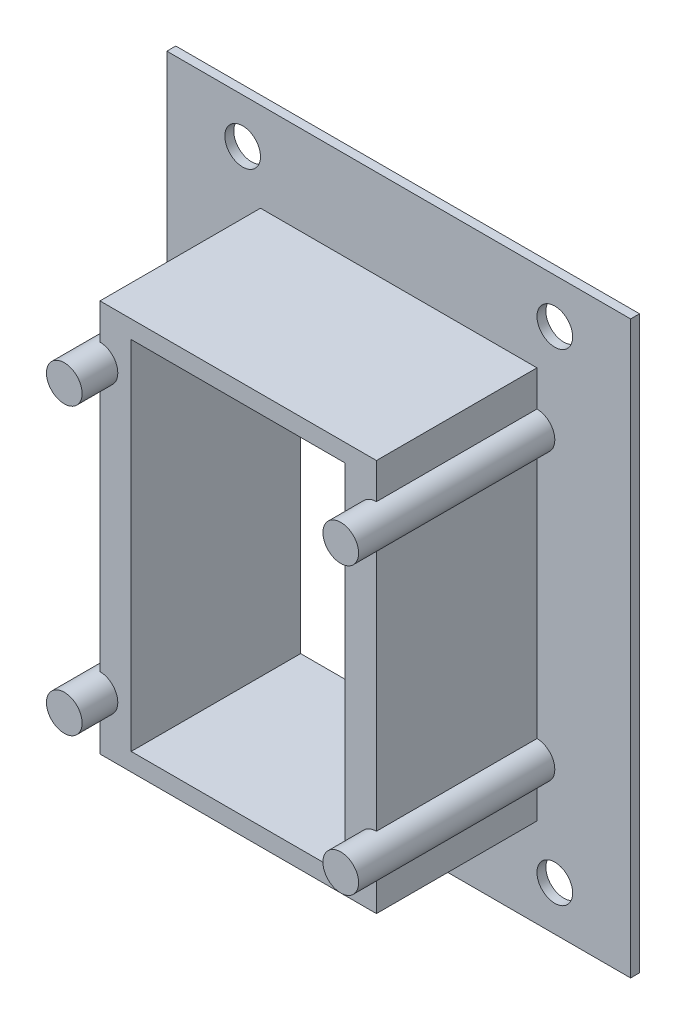
ISO-10303-21;
HEADER;
FILE_DESCRIPTION(('STEP AP214'),'2;1');
FILE_NAME('part.step','',(''),(''),'','','');
FILE_SCHEMA(('AUTOMOTIVE_DESIGN { 1 0 10303 214 1 1 1 1 }'));
ENDSEC;
DATA;
#1=APPLICATION_CONTEXT('core data for automotive mechanical design processes');
#2=APPLICATION_PROTOCOL_DEFINITION('international standard','automotive_design',2000,#1);
#3=PRODUCT_CONTEXT('',#1,'mechanical');
#4=PRODUCT('Part','Part','',(#3));
#5=PRODUCT_RELATED_PRODUCT_CATEGORY('part','',(#4));
#6=PRODUCT_DEFINITION_FORMATION('','',#4);
#7=PRODUCT_DEFINITION_CONTEXT('part definition',#1,'design');
#8=PRODUCT_DEFINITION('design','',#6,#7);
#9=PRODUCT_DEFINITION_SHAPE('','',#8);
#10=(LENGTH_UNIT() NAMED_UNIT(*) SI_UNIT(.MILLI.,.METRE.));
#11=(NAMED_UNIT(*) PLANE_ANGLE_UNIT() SI_UNIT($,.RADIAN.));
#12=(NAMED_UNIT(*) SI_UNIT($,.STERADIAN.) SOLID_ANGLE_UNIT());
#13=UNCERTAINTY_MEASURE_WITH_UNIT(LENGTH_MEASURE(1.E-05),#10,'distance_accuracy_value','');
#14=(GEOMETRIC_REPRESENTATION_CONTEXT(3) GLOBAL_UNCERTAINTY_ASSIGNED_CONTEXT((#13)) GLOBAL_UNIT_ASSIGNED_CONTEXT((#10,
#11,#12)) REPRESENTATION_CONTEXT('',''));
#15=CARTESIAN_POINT('',(0.,0.,0.));
#16=DIRECTION('',(0.,0.,1.));
#17=DIRECTION('',(1.,0.,0.));
#18=AXIS2_PLACEMENT_3D('',#15,#16,#17);
#19=CARTESIAN_POINT('',(24.60625,-34.925,30.1625));
#20=DIRECTION('',(-1.,0.,0.));
#21=DIRECTION('',(0.,0.,1.));
#22=AXIS2_PLACEMENT_3D('',#19,#20,#21);
#23=PLANE('',#22);
#24=DIRECTION('',(0.,0.,-1.));
#25=VECTOR('',#24,1.);
#26=CARTESIAN_POINT('',(24.60625,-22.225,36.5125));
#27=LINE('',#26,#25);
#28=CARTESIAN_POINT('',(24.60625,-22.225,1.5875));
#29=VERTEX_POINT('',#28);
#30=CARTESIAN_POINT('',(24.60625,-22.225,30.1625));
#31=VERTEX_POINT('',#30);
#32=EDGE_CURVE('E268',#29,#31,#27,.F.);
#33=ORIENTED_EDGE('',*,*,#32,.F.);
#34=DIRECTION('',(0.,1.,0.));
#35=VECTOR('',#34,1.);
#36=CARTESIAN_POINT('',(24.60625,-34.925,1.5875));
#37=LINE('',#36,#35);
#38=CARTESIAN_POINT('',(24.60625,22.225,1.5875));
#39=VERTEX_POINT('',#38);
#40=EDGE_CURVE('E343',#29,#39,#37,.T.);
#41=ORIENTED_EDGE('',*,*,#40,.T.);
#42=DIRECTION('',(0.,0.,-1.));
#43=VECTOR('',#42,1.);
#44=CARTESIAN_POINT('',(24.60625,22.225,36.5125));
#45=LINE('',#44,#43);
#46=CARTESIAN_POINT('',(24.60625,22.225,30.1625));
#47=VERTEX_POINT('',#46);
#48=EDGE_CURVE('E293',#47,#39,#45,.T.);
#49=ORIENTED_EDGE('',*,*,#48,.F.);
#50=DIRECTION('',(0.,1.,0.));
#51=VECTOR('',#50,1.);
#52=CARTESIAN_POINT('',(24.60625,-34.925,30.1625));
#53=LINE('',#52,#51);
#54=EDGE_CURVE('E325',#31,#47,#53,.T.);
#55=ORIENTED_EDGE('',*,*,#54,.F.);
#56=EDGE_LOOP('',(#33,#41,#49,#55));
#57=FACE_BOUND('',#56,.T.);
#58=ADVANCED_FACE('F38',(#57),#23,.F.);
#59=DIRECTION('',(0.,0.,-1.));
#60=VECTOR('',#59,1.);
#61=CARTESIAN_POINT('',(24.60625,-28.575,36.5125));
#62=LINE('',#61,#60);
#63=CARTESIAN_POINT('',(24.60625,-28.575,30.1625));
#64=VERTEX_POINT('',#63);
#65=CARTESIAN_POINT('',(24.60625,-28.575,1.5875));
#66=VERTEX_POINT('',#65);
#67=EDGE_CURVE('E261',#64,#66,#62,.T.);
#68=ORIENTED_EDGE('',*,*,#67,.F.);
#69=CARTESIAN_POINT('',(24.60625,-34.925,30.1625));
#70=VERTEX_POINT('',#69);
#71=EDGE_CURVE('E321',#70,#64,#53,.T.);
#72=ORIENTED_EDGE('',*,*,#71,.F.);
#73=DIRECTION('',(0.,0.,-1.));
#74=VECTOR('',#73,1.);
#75=CARTESIAN_POINT('',(24.60625,-34.925,30.1625));
#76=LINE('',#75,#74);
#77=CARTESIAN_POINT('',(24.60625,-34.925,1.5875));
#78=VERTEX_POINT('',#77);
#79=EDGE_CURVE('E337',#70,#78,#76,.T.);
#80=ORIENTED_EDGE('',*,*,#79,.T.);
#81=EDGE_CURVE('E338',#78,#66,#37,.T.);
#82=ORIENTED_EDGE('',*,*,#81,.T.);
#83=EDGE_LOOP('',(#68,#72,#80,#82));
#84=FACE_BOUND('',#83,.T.);
#85=ADVANCED_FACE('F470',(#84),#23,.F.);
#86=CARTESIAN_POINT('',(-24.60625,-34.925,30.1625));
#87=DIRECTION('',(1.,0.,0.));
#88=DIRECTION('',(0.,0.,-1.));
#89=AXIS2_PLACEMENT_3D('',#86,#87,#88);
#90=PLANE('',#89);
#91=DIRECTION('',(0.,0.,-1.));
#92=VECTOR('',#91,1.);
#93=CARTESIAN_POINT('',(-24.60625,-28.575,36.5125));
#94=LINE('',#93,#92);
#95=CARTESIAN_POINT('',(-24.60625,-28.575,1.5875));
#96=VERTEX_POINT('',#95);
#97=CARTESIAN_POINT('',(-24.60625,-28.575,30.1625));
#98=VERTEX_POINT('',#97);
#99=EDGE_CURVE('E284',#96,#98,#94,.F.);
#100=ORIENTED_EDGE('',*,*,#99,.F.);
#101=DIRECTION('',(0.,-1.,0.));
#102=VECTOR('',#101,1.);
#103=CARTESIAN_POINT('',(-24.60625,-34.925,1.5875));
#104=LINE('',#103,#102);
#105=CARTESIAN_POINT('',(-24.60625,-34.925,1.5875));
#106=VERTEX_POINT('',#105);
#107=EDGE_CURVE('E347',#96,#106,#104,.T.);
#108=ORIENTED_EDGE('',*,*,#107,.T.);
#109=DIRECTION('',(0.,0.,-1.));
#110=VECTOR('',#109,1.);
#111=CARTESIAN_POINT('',(-24.60625,-34.925,30.1625));
#112=LINE('',#111,#110);
#113=CARTESIAN_POINT('',(-24.60625,-34.925,30.1625));
#114=VERTEX_POINT('',#113);
#115=EDGE_CURVE('E360',#114,#106,#112,.T.);
#116=ORIENTED_EDGE('',*,*,#115,.F.);
#117=DIRECTION('',(0.,-1.,0.));
#118=VECTOR('',#117,1.);
#119=CARTESIAN_POINT('',(-24.60625,-34.925,30.1625));
#120=LINE('',#119,#118);
#121=EDGE_CURVE('E329',#98,#114,#120,.T.);
#122=ORIENTED_EDGE('',*,*,#121,.F.);
#123=EDGE_LOOP('',(#100,#108,#116,#122));
#124=FACE_BOUND('',#123,.T.);
#125=ADVANCED_FACE('F432',(#124),#90,.F.);
#126=DIRECTION('',(0.,0.,-1.));
#127=VECTOR('',#126,1.);
#128=CARTESIAN_POINT('',(-24.60625,-22.225,36.5125));
#129=LINE('',#128,#127);
#130=CARTESIAN_POINT('',(-24.60625,-22.225,30.1625));
#131=VERTEX_POINT('',#130);
#132=CARTESIAN_POINT('',(-24.60625,-22.225,1.5875));
#133=VERTEX_POINT('',#132);
#134=EDGE_CURVE('E277',#131,#133,#129,.T.);
#135=ORIENTED_EDGE('',*,*,#134,.F.);
#136=CARTESIAN_POINT('',(-24.60625,22.225,30.1625));
#137=VERTEX_POINT('',#136);
#138=EDGE_CURVE('E334',#137,#131,#120,.T.);
#139=ORIENTED_EDGE('',*,*,#138,.F.);
#140=DIRECTION('',(0.,0.,-1.));
#141=VECTOR('',#140,1.);
#142=CARTESIAN_POINT('',(-24.60625,22.225,36.5125));
#143=LINE('',#142,#141);
#144=CARTESIAN_POINT('',(-24.60625,22.225,1.5875));
#145=VERTEX_POINT('',#144);
#146=EDGE_CURVE('E316',#145,#137,#143,.F.);
#147=ORIENTED_EDGE('',*,*,#146,.F.);
#148=EDGE_CURVE('E353',#145,#133,#104,.T.);
#149=ORIENTED_EDGE('',*,*,#148,.T.);
#150=EDGE_LOOP('',(#135,#139,#147,#149));
#151=FACE_BOUND('',#150,.T.);
#152=ADVANCED_FACE('F485',(#151),#90,.F.);
#153=DIRECTION('',(0.,0.,-1.));
#154=VECTOR('',#153,1.);
#155=CARTESIAN_POINT('',(24.60625,28.575,36.5125));
#156=LINE('',#155,#154);
#157=CARTESIAN_POINT('',(24.60625,28.575,1.5875));
#158=VERTEX_POINT('',#157);
#159=CARTESIAN_POINT('',(24.60625,28.575,30.1625));
#160=VERTEX_POINT('',#159);
#161=EDGE_CURVE('E300',#158,#160,#156,.F.);
#162=ORIENTED_EDGE('',*,*,#161,.F.);
#163=CARTESIAN_POINT('',(24.60625,34.925,1.5875));
#164=VERTEX_POINT('',#163);
#165=EDGE_CURVE('E320',#158,#164,#37,.T.);
#166=ORIENTED_EDGE('',*,*,#165,.T.);
#167=DIRECTION('',(0.,0.,-1.));
#168=VECTOR('',#167,1.);
#169=CARTESIAN_POINT('',(24.60625,34.925,30.1625));
#170=LINE('',#169,#168);
#171=CARTESIAN_POINT('',(24.60625,34.925,30.1625));
#172=VERTEX_POINT('',#171);
#173=EDGE_CURVE('E368',#172,#164,#170,.T.);
#174=ORIENTED_EDGE('',*,*,#173,.F.);
#175=EDGE_CURVE('E326',#160,#172,#53,.T.);
#176=ORIENTED_EDGE('',*,*,#175,.F.);
#177=EDGE_LOOP('',(#162,#166,#174,#176));
#178=FACE_BOUND('',#177,.T.);
#179=ADVANCED_FACE('F448',(#178),#23,.F.);
#180=DIRECTION('',(0.,0.,-1.));
#181=VECTOR('',#180,1.);
#182=CARTESIAN_POINT('',(-24.60625,28.575,36.5125));
#183=LINE('',#182,#181);
#184=CARTESIAN_POINT('',(-24.60625,28.575,30.1625));
#185=VERTEX_POINT('',#184);
#186=CARTESIAN_POINT('',(-24.60625,28.575,1.5875));
#187=VERTEX_POINT('',#186);
#188=EDGE_CURVE('E309',#185,#187,#183,.T.);
#189=ORIENTED_EDGE('',*,*,#188,.F.);
#190=CARTESIAN_POINT('',(-24.60625,34.925,30.1625));
#191=VERTEX_POINT('',#190);
#192=EDGE_CURVE('E330',#191,#185,#120,.T.);
#193=ORIENTED_EDGE('',*,*,#192,.F.);
#194=DIRECTION('',(0.,0.,-1.));
#195=VECTOR('',#194,1.);
#196=CARTESIAN_POINT('',(-24.60625,34.925,30.1625));
#197=LINE('',#196,#195);
#198=CARTESIAN_POINT('',(-24.60625,34.925,1.5875));
#199=VERTEX_POINT('',#198);
#200=EDGE_CURVE('E364',#191,#199,#197,.T.);
#201=ORIENTED_EDGE('',*,*,#200,.T.);
#202=EDGE_CURVE('E348',#199,#187,#104,.T.);
#203=ORIENTED_EDGE('',*,*,#202,.T.);
#204=EDGE_LOOP('',(#189,#193,#201,#203));
#205=FACE_BOUND('',#204,.T.);
#206=ADVANCED_FACE('F484',(#205),#90,.F.);
#207=CARTESIAN_POINT('',(0.,0.,1.5875));
#208=DIRECTION('',(0.,0.,-1.));
#209=DIRECTION('',(-1.,0.,0.));
#210=AXIS2_PLACEMENT_3D('',#207,#208,#209);
#211=PLANE('',#210);
#212=CARTESIAN_POINT('',(-27.78125,42.8625,1.5875));
#213=DIRECTION('',(0.,0.,1.));
#214=DIRECTION('',(1.,0.,0.));
#215=AXIS2_PLACEMENT_3D('',#212,#213,#214);
#216=CIRCLE('',#215,3.175);
#217=CARTESIAN_POINT('',(-24.60625,42.8625,1.5875));
#218=VERTEX_POINT('',#217);
#219=EDGE_CURVE('E219',#218,#218,#216,.T.);
#220=ORIENTED_EDGE('',*,*,#219,.F.);
#221=EDGE_LOOP('',(#220));
#222=FACE_BOUND('',#221,.T.);
#223=CARTESIAN_POINT('',(27.78125,42.8625,1.5875));
#224=DIRECTION('',(0.,0.,1.));
#225=DIRECTION('',(1.,0.,0.));
#226=AXIS2_PLACEMENT_3D('',#223,#224,#225);
#227=CIRCLE('',#226,3.175);
#228=CARTESIAN_POINT('',(30.95625,42.8625,1.5875));
#229=VERTEX_POINT('',#228);
#230=EDGE_CURVE('E232',#229,#229,#227,.T.);
#231=ORIENTED_EDGE('',*,*,#230,.F.);
#232=EDGE_LOOP('',(#231));
#233=FACE_BOUND('',#232,.T.);
#234=CARTESIAN_POINT('',(-27.78125,-42.8625,1.5875));
#235=DIRECTION('',(0.,0.,1.));
#236=DIRECTION('',(1.,0.,0.));
#237=AXIS2_PLACEMENT_3D('',#234,#235,#236);
#238=CIRCLE('',#237,3.175);
#239=CARTESIAN_POINT('',(-24.60625,-42.8625,1.5875));
#240=VERTEX_POINT('',#239);
#241=EDGE_CURVE('E240',#240,#240,#238,.T.);
#242=ORIENTED_EDGE('',*,*,#241,.F.);
#243=EDGE_LOOP('',(#242));
#244=FACE_BOUND('',#243,.T.);
#245=CARTESIAN_POINT('',(27.78125,-42.8625,1.5875));
#246=DIRECTION('',(0.,0.,1.));
#247=DIRECTION('',(1.,0.,0.));
#248=AXIS2_PLACEMENT_3D('',#245,#246,#247);
#249=CIRCLE('',#248,3.175);
#250=CARTESIAN_POINT('',(30.95625,-42.8625,1.5875));
#251=VERTEX_POINT('',#250);
#252=EDGE_CURVE('E248',#251,#251,#249,.T.);
#253=ORIENTED_EDGE('',*,*,#252,.F.);
#254=EDGE_LOOP('',(#253));
#255=FACE_BOUND('',#254,.T.);
#256=CARTESIAN_POINT('',(24.60625,-25.4,1.5875));
#257=DIRECTION('',(0.,0.,1.));
#258=DIRECTION('',(1.,0.,0.));
#259=AXIS2_PLACEMENT_3D('',#256,#257,#258);
#260=CIRCLE('',#259,3.175);
#261=EDGE_CURVE('E256',#66,#29,#260,.T.);
#262=ORIENTED_EDGE('',*,*,#261,.F.);
#263=ORIENTED_EDGE('',*,*,#81,.F.);
#264=DIRECTION('',(1.,0.,0.));
#265=VECTOR('',#264,1.);
#266=CARTESIAN_POINT('',(-24.60625,-34.925,1.5875));
#267=LINE('',#266,#265);
#268=EDGE_CURVE('E352',#106,#78,#267,.T.);
#269=ORIENTED_EDGE('',*,*,#268,.F.);
#270=ORIENTED_EDGE('',*,*,#107,.F.);
#271=CARTESIAN_POINT('',(-24.60625,-25.4,1.5875));
#272=DIRECTION('',(0.,0.,1.));
#273=DIRECTION('',(1.,0.,0.));
#274=AXIS2_PLACEMENT_3D('',#271,#272,#273);
#275=CIRCLE('',#274,3.175);
#276=EDGE_CURVE('E272',#133,#96,#275,.T.);
#277=ORIENTED_EDGE('',*,*,#276,.F.);
#278=ORIENTED_EDGE('',*,*,#148,.F.);
#279=CARTESIAN_POINT('',(-24.60625,25.4,1.5875));
#280=DIRECTION('',(0.,0.,1.));
#281=DIRECTION('',(1.,0.,0.));
#282=AXIS2_PLACEMENT_3D('',#279,#280,#281);
#283=CIRCLE('',#282,3.175);
#284=EDGE_CURVE('E304',#187,#145,#283,.T.);
#285=ORIENTED_EDGE('',*,*,#284,.F.);
#286=ORIENTED_EDGE('',*,*,#202,.F.);
#287=DIRECTION('',(-1.,0.,0.));
#288=VECTOR('',#287,1.);
#289=CARTESIAN_POINT('',(-24.60625,34.925,1.5875));
#290=LINE('',#289,#288);
#291=EDGE_CURVE('E342',#164,#199,#290,.T.);
#292=ORIENTED_EDGE('',*,*,#291,.F.);
#293=ORIENTED_EDGE('',*,*,#165,.F.);
#294=CARTESIAN_POINT('',(24.60625,25.4,1.5875));
#295=DIRECTION('',(0.,0.,1.));
#296=DIRECTION('',(1.,0.,0.));
#297=AXIS2_PLACEMENT_3D('',#294,#295,#296);
#298=CIRCLE('',#297,3.175);
#299=EDGE_CURVE('E288',#39,#158,#298,.T.);
#300=ORIENTED_EDGE('',*,*,#299,.F.);
#301=ORIENTED_EDGE('',*,*,#40,.F.);
#302=EDGE_LOOP('',(#262,#263,#269,#270,#277,#278,#285,#286,#292,#293,#300,#301));
#303=FACE_BOUND('',#302,.T.);
#304=DIRECTION('',(0.,1.,0.));
#305=VECTOR('',#304,1.);
#306=CARTESIAN_POINT('',(41.275,-50.8,1.5875));
#307=LINE('',#306,#305);
#308=CARTESIAN_POINT('',(41.275,-50.8,1.5875));
#309=VERTEX_POINT('',#308);
#310=CARTESIAN_POINT('',(41.275,50.8,1.5875));
#311=VERTEX_POINT('',#310);
#312=EDGE_CURVE('E373',#309,#311,#307,.T.);
#313=ORIENTED_EDGE('',*,*,#312,.T.);
#314=DIRECTION('',(-1.,0.,0.));
#315=VECTOR('',#314,1.);
#316=CARTESIAN_POINT('',(-41.275,50.8,1.5875));
#317=LINE('',#316,#315);
#318=CARTESIAN_POINT('',(-41.275,50.8,1.5875));
#319=VERTEX_POINT('',#318);
#320=EDGE_CURVE('E377',#311,#319,#317,.T.);
#321=ORIENTED_EDGE('',*,*,#320,.T.);
#322=DIRECTION('',(0.,-1.,0.));
#323=VECTOR('',#322,1.);
#324=CARTESIAN_POINT('',(-41.275,-50.8,1.5875));
#325=LINE('',#324,#323);
#326=CARTESIAN_POINT('',(-41.275,-50.8,1.5875));
#327=VERTEX_POINT('',#326);
#328=EDGE_CURVE('E381',#319,#327,#325,.T.);
#329=ORIENTED_EDGE('',*,*,#328,.T.);
#330=DIRECTION('',(1.,0.,0.));
#331=VECTOR('',#330,1.);
#332=CARTESIAN_POINT('',(-41.275,-50.8,1.5875));
#333=LINE('',#332,#331);
#334=EDGE_CURVE('E384',#327,#309,#333,.T.);
#335=ORIENTED_EDGE('',*,*,#334,.T.);
#336=EDGE_LOOP('',(#313,#321,#329,#335));
#337=FACE_BOUND('',#336,.T.);
#338=ADVANCED_FACE('F452',(#222,#233,#244,#255,#303,#337),#211,.F.);
#339=CARTESIAN_POINT('',(41.275,-50.8,1.5875));
#340=DIRECTION('',(-1.,0.,0.));
#341=DIRECTION('',(0.,0.,1.));
#342=AXIS2_PLACEMENT_3D('',#339,#340,#341);
#343=PLANE('',#342);
#344=DIRECTION('',(0.,1.,0.));
#345=VECTOR('',#344,1.);
#346=CARTESIAN_POINT('',(41.275,-50.8,0.));
#347=LINE('',#346,#345);
#348=CARTESIAN_POINT('',(41.275,-50.8,0.));
#349=VERTEX_POINT('',#348);
#350=CARTESIAN_POINT('',(41.275,50.8,0.));
#351=VERTEX_POINT('',#350);
#352=EDGE_CURVE('E372',#349,#351,#347,.T.);
#353=ORIENTED_EDGE('',*,*,#352,.T.);
#354=DIRECTION('',(0.,0.,-1.));
#355=VECTOR('',#354,1.);
#356=CARTESIAN_POINT('',(41.275,50.8,1.5875));
#357=LINE('',#356,#355);
#358=EDGE_CURVE('E410',#311,#351,#357,.T.);
#359=ORIENTED_EDGE('',*,*,#358,.F.);
#360=ORIENTED_EDGE('',*,*,#312,.F.);
#361=DIRECTION('',(0.,0.,-1.));
#362=VECTOR('',#361,1.);
#363=CARTESIAN_POINT('',(41.275,-50.8,1.5875));
#364=LINE('',#363,#362);
#365=EDGE_CURVE('E387',#309,#349,#364,.T.);
#366=ORIENTED_EDGE('',*,*,#365,.T.);
#367=EDGE_LOOP('',(#353,#359,#360,#366));
#368=FACE_BOUND('',#367,.T.);
#369=ADVANCED_FACE('F40',(#368),#343,.F.);
#370=CARTESIAN_POINT('',(-41.275,50.8,1.5875));
#371=DIRECTION('',(0.,-1.,0.));
#372=DIRECTION('',(0.,0.,-1.));
#373=AXIS2_PLACEMENT_3D('',#370,#371,#372);
#374=PLANE('',#373);
#375=DIRECTION('',(-1.,0.,0.));
#376=VECTOR('',#375,1.);
#377=CARTESIAN_POINT('',(-41.275,50.8,0.));
#378=LINE('',#377,#376);
#379=CARTESIAN_POINT('',(-41.275,50.8,0.));
#380=VERTEX_POINT('',#379);
#381=EDGE_CURVE('E391',#351,#380,#378,.T.);
#382=ORIENTED_EDGE('',*,*,#381,.T.);
#383=DIRECTION('',(0.,0.,-1.));
#384=VECTOR('',#383,1.);
#385=CARTESIAN_POINT('',(-41.275,50.8,1.5875));
#386=LINE('',#385,#384);
#387=EDGE_CURVE('E406',#319,#380,#386,.T.);
#388=ORIENTED_EDGE('',*,*,#387,.F.);
#389=ORIENTED_EDGE('',*,*,#320,.F.);
#390=ORIENTED_EDGE('',*,*,#358,.T.);
#391=EDGE_LOOP('',(#382,#388,#389,#390));
#392=FACE_BOUND('',#391,.T.);
#393=ADVANCED_FACE('F515',(#392),#374,.F.);
#394=CARTESIAN_POINT('',(-41.275,-50.8,1.5875));
#395=DIRECTION('',(1.,0.,0.));
#396=DIRECTION('',(0.,0.,-1.));
#397=AXIS2_PLACEMENT_3D('',#394,#395,#396);
#398=PLANE('',#397);
#399=DIRECTION('',(0.,-1.,0.));
#400=VECTOR('',#399,1.);
#401=CARTESIAN_POINT('',(-41.275,-50.8,0.));
#402=LINE('',#401,#400);
#403=CARTESIAN_POINT('',(-41.275,-50.8,0.));
#404=VERTEX_POINT('',#403);
#405=EDGE_CURVE('E394',#380,#404,#402,.T.);
#406=ORIENTED_EDGE('',*,*,#405,.T.);
#407=DIRECTION('',(0.,0.,-1.));
#408=VECTOR('',#407,1.);
#409=CARTESIAN_POINT('',(-41.275,-50.8,1.5875));
#410=LINE('',#409,#408);
#411=EDGE_CURVE('E402',#327,#404,#410,.T.);
#412=ORIENTED_EDGE('',*,*,#411,.F.);
#413=ORIENTED_EDGE('',*,*,#328,.F.);
#414=ORIENTED_EDGE('',*,*,#387,.T.);
#415=EDGE_LOOP('',(#406,#412,#413,#414));
#416=FACE_BOUND('',#415,.T.);
#417=ADVANCED_FACE('F510',(#416),#398,.F.);
#418=CARTESIAN_POINT('',(-41.275,-50.8,1.5875));
#419=DIRECTION('',(0.,1.,0.));
#420=DIRECTION('',(0.,0.,1.));
#421=AXIS2_PLACEMENT_3D('',#418,#419,#420);
#422=PLANE('',#421);
#423=DIRECTION('',(1.,0.,0.));
#424=VECTOR('',#423,1.);
#425=CARTESIAN_POINT('',(-41.275,-50.8,0.));
#426=LINE('',#425,#424);
#427=EDGE_CURVE('E378',#404,#349,#426,.T.);
#428=ORIENTED_EDGE('',*,*,#427,.T.);
#429=ORIENTED_EDGE('',*,*,#365,.F.);
#430=ORIENTED_EDGE('',*,*,#334,.F.);
#431=ORIENTED_EDGE('',*,*,#411,.T.);
#432=EDGE_LOOP('',(#428,#429,#430,#431));
#433=FACE_BOUND('',#432,.T.);
#434=ADVANCED_FACE('F504',(#433),#422,.F.);
#435=CARTESIAN_POINT('',(0.,0.,0.));
#436=DIRECTION('',(0.,0.,-1.));
#437=DIRECTION('',(-1.,0.,0.));
#438=AXIS2_PLACEMENT_3D('',#435,#436,#437);
#439=PLANE('',#438);
#440=DIRECTION('',(0.,-1.,0.));
#441=VECTOR('',#440,1.);
#442=CARTESIAN_POINT('',(-19.05,-31.75,0.));
#443=LINE('',#442,#441);
#444=CARTESIAN_POINT('',(-19.05,31.75,0.));
#445=VERTEX_POINT('',#444);
#446=CARTESIAN_POINT('',(-19.05,-31.75,0.));
#447=VERTEX_POINT('',#446);
#448=EDGE_CURVE('E178',#445,#447,#443,.T.);
#449=ORIENTED_EDGE('',*,*,#448,.T.);
#450=DIRECTION('',(1.,0.,0.));
#451=VECTOR('',#450,1.);
#452=CARTESIAN_POINT('',(19.05,-31.75,0.));
#453=LINE('',#452,#451);
#454=CARTESIAN_POINT('',(19.05,-31.75,0.));
#455=VERTEX_POINT('',#454);
#456=EDGE_CURVE('E188',#447,#455,#453,.T.);
#457=ORIENTED_EDGE('',*,*,#456,.T.);
#458=DIRECTION('',(0.,1.,0.));
#459=VECTOR('',#458,1.);
#460=CARTESIAN_POINT('',(19.05,-31.75,0.));
#461=LINE('',#460,#459);
#462=CARTESIAN_POINT('',(19.05,31.75,0.));
#463=VERTEX_POINT('',#462);
#464=EDGE_CURVE('E54',#455,#463,#461,.T.);
#465=ORIENTED_EDGE('',*,*,#464,.T.);
#466=DIRECTION('',(-1.,0.,0.));
#467=VECTOR('',#466,1.);
#468=CARTESIAN_POINT('',(19.05,31.75,0.));
#469=LINE('',#468,#467);
#470=EDGE_CURVE('E185',#463,#445,#469,.T.);
#471=ORIENTED_EDGE('',*,*,#470,.T.);
#472=EDGE_LOOP('',(#449,#457,#465,#471));
#473=FACE_BOUND('',#472,.T.);
#474=CARTESIAN_POINT('',(-27.78125,42.8625,0.));
#475=DIRECTION('',(0.,0.,1.));
#476=DIRECTION('',(1.,0.,0.));
#477=AXIS2_PLACEMENT_3D('',#474,#475,#476);
#478=CIRCLE('',#477,3.175);
#479=CARTESIAN_POINT('',(-24.60625,42.8625,0.));
#480=VERTEX_POINT('',#479);
#481=EDGE_CURVE('E228',#480,#480,#478,.T.);
#482=ORIENTED_EDGE('',*,*,#481,.T.);
#483=EDGE_LOOP('',(#482));
#484=FACE_BOUND('',#483,.T.);
#485=CARTESIAN_POINT('',(27.78125,42.8625,0.));
#486=DIRECTION('',(0.,0.,1.));
#487=DIRECTION('',(1.,0.,0.));
#488=AXIS2_PLACEMENT_3D('',#485,#486,#487);
#489=CIRCLE('',#488,3.175);
#490=CARTESIAN_POINT('',(30.95625,42.8625,0.));
#491=VERTEX_POINT('',#490);
#492=EDGE_CURVE('E236',#491,#491,#489,.T.);
#493=ORIENTED_EDGE('',*,*,#492,.T.);
#494=EDGE_LOOP('',(#493));
#495=FACE_BOUND('',#494,.T.);
#496=CARTESIAN_POINT('',(-27.78125,-42.8625,0.));
#497=DIRECTION('',(0.,0.,1.));
#498=DIRECTION('',(1.,0.,0.));
#499=AXIS2_PLACEMENT_3D('',#496,#497,#498);
#500=CIRCLE('',#499,3.175);
#501=CARTESIAN_POINT('',(-24.60625,-42.8625,0.));
#502=VERTEX_POINT('',#501);
#503=EDGE_CURVE('E244',#502,#502,#500,.T.);
#504=ORIENTED_EDGE('',*,*,#503,.T.);
#505=EDGE_LOOP('',(#504));
#506=FACE_BOUND('',#505,.T.);
#507=CARTESIAN_POINT('',(27.78125,-42.8625,0.));
#508=DIRECTION('',(0.,0.,1.));
#509=DIRECTION('',(1.,0.,0.));
#510=AXIS2_PLACEMENT_3D('',#507,#508,#509);
#511=CIRCLE('',#510,3.175);
#512=CARTESIAN_POINT('',(30.95625,-42.8625,0.));
#513=VERTEX_POINT('',#512);
#514=EDGE_CURVE('E252',#513,#513,#511,.T.);
#515=ORIENTED_EDGE('',*,*,#514,.T.);
#516=EDGE_LOOP('',(#515));
#517=FACE_BOUND('',#516,.T.);
#518=ORIENTED_EDGE('',*,*,#352,.F.);
#519=ORIENTED_EDGE('',*,*,#427,.F.);
#520=ORIENTED_EDGE('',*,*,#405,.F.);
#521=ORIENTED_EDGE('',*,*,#381,.F.);
#522=EDGE_LOOP('',(#518,#519,#520,#521));
#523=FACE_BOUND('',#522,.T.);
#524=ADVANCED_FACE('F193',(#473,#484,#495,#506,#517,#523),#439,.T.);
#525=CARTESIAN_POINT('',(-24.60625,34.925,30.1625));
#526=DIRECTION('',(0.,-1.,0.));
#527=DIRECTION('',(0.,0.,-1.));
#528=AXIS2_PLACEMENT_3D('',#525,#526,#527);
#529=PLANE('',#528);
#530=ORIENTED_EDGE('',*,*,#291,.T.);
#531=ORIENTED_EDGE('',*,*,#200,.F.);
#532=DIRECTION('',(-1.,0.,0.));
#533=VECTOR('',#532,1.);
#534=CARTESIAN_POINT('',(-24.60625,34.925,30.1625));
#535=LINE('',#534,#533);
#536=EDGE_CURVE('E324',#172,#191,#535,.T.);
#537=ORIENTED_EDGE('',*,*,#536,.F.);
#538=ORIENTED_EDGE('',*,*,#173,.T.);
#539=EDGE_LOOP('',(#530,#531,#537,#538));
#540=FACE_BOUND('',#539,.T.);
#541=ADVANCED_FACE('F457',(#540),#529,.F.);
#542=CARTESIAN_POINT('',(-24.60625,-34.925,30.1625));
#543=DIRECTION('',(0.,1.,0.));
#544=DIRECTION('',(0.,0.,1.));
#545=AXIS2_PLACEMENT_3D('',#542,#543,#544);
#546=PLANE('',#545);
#547=ORIENTED_EDGE('',*,*,#268,.T.);
#548=ORIENTED_EDGE('',*,*,#79,.F.);
#549=DIRECTION('',(1.,0.,0.));
#550=VECTOR('',#549,1.);
#551=CARTESIAN_POINT('',(-24.60625,-34.925,30.1625));
#552=LINE('',#551,#550);
#553=EDGE_CURVE('E333',#114,#70,#552,.T.);
#554=ORIENTED_EDGE('',*,*,#553,.F.);
#555=ORIENTED_EDGE('',*,*,#115,.T.);
#556=EDGE_LOOP('',(#547,#548,#554,#555));
#557=FACE_BOUND('',#556,.T.);
#558=ADVANCED_FACE('F474',(#557),#546,.F.);
#559=CARTESIAN_POINT('',(0.,0.,30.1625));
#560=DIRECTION('',(0.,0.,-1.));
#561=DIRECTION('',(-1.,0.,0.));
#562=AXIS2_PLACEMENT_3D('',#559,#560,#561);
#563=PLANE('',#562);
#564=DIRECTION('',(1.,0.,0.));
#565=VECTOR('',#564,1.);
#566=CARTESIAN_POINT('',(19.05,-31.75,30.1625));
#567=LINE('',#566,#565);
#568=CARTESIAN_POINT('',(-19.05,-31.75,30.1625));
#569=VERTEX_POINT('',#568);
#570=CARTESIAN_POINT('',(19.05,-31.75,30.1625));
#571=VERTEX_POINT('',#570);
#572=EDGE_CURVE('E210',#569,#571,#567,.T.);
#573=ORIENTED_EDGE('',*,*,#572,.F.);
#574=DIRECTION('',(0.,-1.,0.));
#575=VECTOR('',#574,1.);
#576=CARTESIAN_POINT('',(-19.05,-31.75,30.1625));
#577=LINE('',#576,#575);
#578=CARTESIAN_POINT('',(-19.05,31.75,30.1625));
#579=VERTEX_POINT('',#578);
#580=EDGE_CURVE('E62',#579,#569,#577,.T.);
#581=ORIENTED_EDGE('',*,*,#580,.F.);
#582=DIRECTION('',(-1.,0.,0.));
#583=VECTOR('',#582,1.);
#584=CARTESIAN_POINT('',(19.05,31.75,30.1625));
#585=LINE('',#584,#583);
#586=CARTESIAN_POINT('',(19.05,31.75,30.1625));
#587=VERTEX_POINT('',#586);
#588=EDGE_CURVE('E197',#587,#579,#585,.T.);
#589=ORIENTED_EDGE('',*,*,#588,.F.);
#590=DIRECTION('',(0.,1.,0.));
#591=VECTOR('',#590,1.);
#592=CARTESIAN_POINT('',(19.05,-31.75,30.1625));
#593=LINE('',#592,#591);
#594=EDGE_CURVE('E201',#571,#587,#593,.T.);
#595=ORIENTED_EDGE('',*,*,#594,.F.);
#596=EDGE_LOOP('',(#573,#581,#589,#595));
#597=FACE_BOUND('',#596,.T.);
#598=CARTESIAN_POINT('',(24.60625,-25.4,30.1625));
#599=DIRECTION('',(0.,0.,-1.));
#600=DIRECTION('',(-1.,0.,0.));
#601=AXIS2_PLACEMENT_3D('',#598,#599,#600);
#602=CIRCLE('',#601,3.175);
#603=EDGE_CURVE('E11',#31,#64,#602,.F.);
#604=ORIENTED_EDGE('',*,*,#603,.F.);
#605=ORIENTED_EDGE('',*,*,#54,.T.);
#606=CARTESIAN_POINT('',(24.60625,25.4,30.1625));
#607=DIRECTION('',(0.,0.,-1.));
#608=DIRECTION('',(-1.,0.,0.));
#609=AXIS2_PLACEMENT_3D('',#606,#607,#608);
#610=CIRCLE('',#609,3.175);
#611=EDGE_CURVE('E418',#160,#47,#610,.F.);
#612=ORIENTED_EDGE('',*,*,#611,.F.);
#613=ORIENTED_EDGE('',*,*,#175,.T.);
#614=ORIENTED_EDGE('',*,*,#536,.T.);
#615=ORIENTED_EDGE('',*,*,#192,.T.);
#616=CARTESIAN_POINT('',(-24.60625,25.4,30.1625));
#617=DIRECTION('',(0.,0.,-1.));
#618=DIRECTION('',(-1.,0.,0.));
#619=AXIS2_PLACEMENT_3D('',#616,#617,#618);
#620=CIRCLE('',#619,3.175);
#621=EDGE_CURVE('E414',#137,#185,#620,.F.);
#622=ORIENTED_EDGE('',*,*,#621,.F.);
#623=ORIENTED_EDGE('',*,*,#138,.T.);
#624=CARTESIAN_POINT('',(-24.60625,-25.4,30.1625));
#625=DIRECTION('',(0.,0.,-1.));
#626=DIRECTION('',(-1.,0.,0.));
#627=AXIS2_PLACEMENT_3D('',#624,#625,#626);
#628=CIRCLE('',#627,3.175);
#629=EDGE_CURVE('E47',#98,#131,#628,.F.);
#630=ORIENTED_EDGE('',*,*,#629,.F.);
#631=ORIENTED_EDGE('',*,*,#121,.T.);
#632=ORIENTED_EDGE('',*,*,#553,.T.);
#633=ORIENTED_EDGE('',*,*,#71,.T.);
#634=EDGE_LOOP('',(#604,#605,#612,#613,#614,#615,#622,#623,#630,#631,#632,#633));
#635=FACE_BOUND('',#634,.T.);
#636=ADVANCED_FACE('F428',(#597,#635),#563,.F.);
#637=CARTESIAN_POINT('',(-24.60625,25.4,36.5125));
#638=DIRECTION('',(0.,0.,-1.));
#639=DIRECTION('',(-1.,0.,0.));
#640=AXIS2_PLACEMENT_3D('',#637,#638,#639);
#641=CYLINDRICAL_SURFACE('',#640,3.175);
#642=CARTESIAN_POINT('',(-24.60625,25.4,36.5125));
#643=DIRECTION('',(0.,0.,1.));
#644=DIRECTION('',(1.,0.,0.));
#645=AXIS2_PLACEMENT_3D('',#642,#643,#644);
#646=CIRCLE('',#645,3.175);
#647=CARTESIAN_POINT('',(-21.43125,25.4,36.5125));
#648=VERTEX_POINT('',#647);
#649=EDGE_CURVE('E305',#648,#648,#646,.T.);
#650=ORIENTED_EDGE('',*,*,#649,.F.);
#651=EDGE_LOOP('',(#650));
#652=FACE_BOUND('',#651,.T.);
#653=ORIENTED_EDGE('',*,*,#284,.T.);
#654=ORIENTED_EDGE('',*,*,#146,.T.);
#655=ORIENTED_EDGE('',*,*,#621,.T.);
#656=ORIENTED_EDGE('',*,*,#188,.T.);
#657=EDGE_LOOP('',(#653,#654,#655,#656));
#658=FACE_BOUND('',#657,.T.);
#659=ADVANCED_FACE('F585',(#652,#658),#641,.T.);
#660=CARTESIAN_POINT('',(-24.60625,25.4,36.5125));
#661=DIRECTION('',(0.,0.,1.));
#662=DIRECTION('',(1.,0.,0.));
#663=AXIS2_PLACEMENT_3D('',#660,#661,#662);
#664=PLANE('',#663);
#665=ORIENTED_EDGE('',*,*,#649,.T.);
#666=EDGE_LOOP('',(#665));
#667=FACE_BOUND('',#666,.T.);
#668=ADVANCED_FACE('F581',(#667),#664,.T.);
#669=CARTESIAN_POINT('',(24.60625,25.4,36.5125));
#670=DIRECTION('',(0.,0.,-1.));
#671=DIRECTION('',(-1.,0.,0.));
#672=AXIS2_PLACEMENT_3D('',#669,#670,#671);
#673=CYLINDRICAL_SURFACE('',#672,3.175);
#674=CARTESIAN_POINT('',(24.60625,25.4,36.5125));
#675=DIRECTION('',(0.,0.,1.));
#676=DIRECTION('',(1.,0.,0.));
#677=AXIS2_PLACEMENT_3D('',#674,#675,#676);
#678=CIRCLE('',#677,3.175);
#679=CARTESIAN_POINT('',(27.78125,25.4,36.5125));
#680=VERTEX_POINT('',#679);
#681=EDGE_CURVE('E289',#680,#680,#678,.T.);
#682=ORIENTED_EDGE('',*,*,#681,.F.);
#683=EDGE_LOOP('',(#682));
#684=FACE_BOUND('',#683,.T.);
#685=ORIENTED_EDGE('',*,*,#299,.T.);
#686=ORIENTED_EDGE('',*,*,#161,.T.);
#687=ORIENTED_EDGE('',*,*,#611,.T.);
#688=ORIENTED_EDGE('',*,*,#48,.T.);
#689=EDGE_LOOP('',(#685,#686,#687,#688));
#690=FACE_BOUND('',#689,.T.);
#691=ADVANCED_FACE('F461',(#684,#690),#673,.T.);
#692=CARTESIAN_POINT('',(24.60625,25.4,36.5125));
#693=DIRECTION('',(0.,0.,1.));
#694=DIRECTION('',(1.,0.,0.));
#695=AXIS2_PLACEMENT_3D('',#692,#693,#694);
#696=PLANE('',#695);
#697=ORIENTED_EDGE('',*,*,#681,.T.);
#698=EDGE_LOOP('',(#697));
#699=FACE_BOUND('',#698,.T.);
#700=ADVANCED_FACE('F574',(#699),#696,.T.);
#701=CARTESIAN_POINT('',(-24.60625,-25.4,36.5125));
#702=DIRECTION('',(0.,0.,-1.));
#703=DIRECTION('',(-1.,0.,0.));
#704=AXIS2_PLACEMENT_3D('',#701,#702,#703);
#705=CYLINDRICAL_SURFACE('',#704,3.175);
#706=CARTESIAN_POINT('',(-24.60625,-25.4,36.5125));
#707=DIRECTION('',(0.,0.,1.));
#708=DIRECTION('',(1.,0.,0.));
#709=AXIS2_PLACEMENT_3D('',#706,#707,#708);
#710=CIRCLE('',#709,3.175);
#711=CARTESIAN_POINT('',(-21.43125,-25.4,36.5125));
#712=VERTEX_POINT('',#711);
#713=EDGE_CURVE('E273',#712,#712,#710,.T.);
#714=ORIENTED_EDGE('',*,*,#713,.F.);
#715=EDGE_LOOP('',(#714));
#716=FACE_BOUND('',#715,.T.);
#717=ORIENTED_EDGE('',*,*,#276,.T.);
#718=ORIENTED_EDGE('',*,*,#99,.T.);
#719=ORIENTED_EDGE('',*,*,#629,.T.);
#720=ORIENTED_EDGE('',*,*,#134,.T.);
#721=EDGE_LOOP('',(#717,#718,#719,#720));
#722=FACE_BOUND('',#721,.T.);
#723=ADVANCED_FACE('F424',(#716,#722),#705,.T.);
#724=CARTESIAN_POINT('',(-24.60625,-25.4,36.5125));
#725=DIRECTION('',(0.,0.,1.));
#726=DIRECTION('',(1.,0.,0.));
#727=AXIS2_PLACEMENT_3D('',#724,#725,#726);
#728=PLANE('',#727);
#729=ORIENTED_EDGE('',*,*,#713,.T.);
#730=EDGE_LOOP('',(#729));
#731=FACE_BOUND('',#730,.T.);
#732=ADVANCED_FACE('F567',(#731),#728,.T.);
#733=CARTESIAN_POINT('',(24.60625,-25.4,36.5125));
#734=DIRECTION('',(0.,0.,-1.));
#735=DIRECTION('',(-1.,0.,0.));
#736=AXIS2_PLACEMENT_3D('',#733,#734,#735);
#737=CYLINDRICAL_SURFACE('',#736,3.175);
#738=CARTESIAN_POINT('',(24.60625,-25.4,36.5125));
#739=DIRECTION('',(0.,0.,1.));
#740=DIRECTION('',(1.,0.,0.));
#741=AXIS2_PLACEMENT_3D('',#738,#739,#740);
#742=CIRCLE('',#741,3.175);
#743=CARTESIAN_POINT('',(27.78125,-25.4,36.5125));
#744=VERTEX_POINT('',#743);
#745=EDGE_CURVE('E257',#744,#744,#742,.T.);
#746=ORIENTED_EDGE('',*,*,#745,.F.);
#747=EDGE_LOOP('',(#746));
#748=FACE_BOUND('',#747,.T.);
#749=ORIENTED_EDGE('',*,*,#261,.T.);
#750=ORIENTED_EDGE('',*,*,#32,.T.);
#751=ORIENTED_EDGE('',*,*,#603,.T.);
#752=ORIENTED_EDGE('',*,*,#67,.T.);
#753=EDGE_LOOP('',(#749,#750,#751,#752));
#754=FACE_BOUND('',#753,.T.);
#755=ADVANCED_FACE('F466',(#748,#754),#737,.T.);
#756=CARTESIAN_POINT('',(24.60625,-25.4,36.5125));
#757=DIRECTION('',(0.,0.,1.));
#758=DIRECTION('',(1.,0.,0.));
#759=AXIS2_PLACEMENT_3D('',#756,#757,#758);
#760=PLANE('',#759);
#761=ORIENTED_EDGE('',*,*,#745,.T.);
#762=EDGE_LOOP('',(#761));
#763=FACE_BOUND('',#762,.T.);
#764=ADVANCED_FACE('F551',(#763),#760,.T.);
#765=CARTESIAN_POINT('',(27.78125,-42.8625,1.5875));
#766=DIRECTION('',(0.,0.,1.));
#767=DIRECTION('',(1.,0.,0.));
#768=AXIS2_PLACEMENT_3D('',#765,#766,#767);
#769=CYLINDRICAL_SURFACE('',#768,3.175);
#770=ORIENTED_EDGE('',*,*,#514,.F.);
#771=EDGE_LOOP('',(#770));
#772=FACE_BOUND('',#771,.T.);
#773=ORIENTED_EDGE('',*,*,#252,.T.);
#774=EDGE_LOOP('',(#773));
#775=FACE_BOUND('',#774,.T.);
#776=ADVANCED_FACE('F548',(#772,#775),#769,.F.);
#777=CARTESIAN_POINT('',(-27.78125,-42.8625,1.5875));
#778=DIRECTION('',(0.,0.,1.));
#779=DIRECTION('',(1.,0.,0.));
#780=AXIS2_PLACEMENT_3D('',#777,#778,#779);
#781=CYLINDRICAL_SURFACE('',#780,3.175);
#782=ORIENTED_EDGE('',*,*,#503,.F.);
#783=EDGE_LOOP('',(#782));
#784=FACE_BOUND('',#783,.T.);
#785=ORIENTED_EDGE('',*,*,#241,.T.);
#786=EDGE_LOOP('',(#785));
#787=FACE_BOUND('',#786,.T.);
#788=ADVANCED_FACE('F550',(#784,#787),#781,.F.);
#789=CARTESIAN_POINT('',(27.78125,42.8625,1.5875));
#790=DIRECTION('',(0.,0.,1.));
#791=DIRECTION('',(1.,0.,0.));
#792=AXIS2_PLACEMENT_3D('',#789,#790,#791);
#793=CYLINDRICAL_SURFACE('',#792,3.175);
#794=ORIENTED_EDGE('',*,*,#492,.F.);
#795=EDGE_LOOP('',(#794));
#796=FACE_BOUND('',#795,.T.);
#797=ORIENTED_EDGE('',*,*,#230,.T.);
#798=EDGE_LOOP('',(#797));
#799=FACE_BOUND('',#798,.T.);
#800=ADVANCED_FACE('F557',(#796,#799),#793,.F.);
#801=CARTESIAN_POINT('',(-27.78125,42.8625,1.5875));
#802=DIRECTION('',(0.,0.,1.));
#803=DIRECTION('',(1.,0.,0.));
#804=AXIS2_PLACEMENT_3D('',#801,#802,#803);
#805=CYLINDRICAL_SURFACE('',#804,3.175);
#806=ORIENTED_EDGE('',*,*,#481,.F.);
#807=EDGE_LOOP('',(#806));
#808=FACE_BOUND('',#807,.T.);
#809=ORIENTED_EDGE('',*,*,#219,.T.);
#810=EDGE_LOOP('',(#809));
#811=FACE_BOUND('',#810,.T.);
#812=ADVANCED_FACE('F605',(#808,#811),#805,.F.);
#813=CARTESIAN_POINT('',(-19.05,-31.75,0.));
#814=DIRECTION('',(-1.,0.,0.));
#815=DIRECTION('',(0.,0.,1.));
#816=AXIS2_PLACEMENT_3D('',#813,#814,#815);
#817=PLANE('',#816);
#818=ORIENTED_EDGE('',*,*,#580,.T.);
#819=DIRECTION('',(0.,0.,1.));
#820=VECTOR('',#819,1.);
#821=CARTESIAN_POINT('',(-19.05,-31.75,0.));
#822=LINE('',#821,#820);
#823=EDGE_CURVE('E174',#447,#569,#822,.T.);
#824=ORIENTED_EDGE('',*,*,#823,.F.);
#825=ORIENTED_EDGE('',*,*,#448,.F.);
#826=DIRECTION('',(0.,0.,1.));
#827=VECTOR('',#826,1.);
#828=CARTESIAN_POINT('',(-19.05,31.75,0.));
#829=LINE('',#828,#827);
#830=EDGE_CURVE('E216',#445,#579,#829,.T.);
#831=ORIENTED_EDGE('',*,*,#830,.T.);
#832=EDGE_LOOP('',(#818,#824,#825,#831));
#833=FACE_BOUND('',#832,.T.);
#834=ADVANCED_FACE('F176',(#833),#817,.F.);
#835=CARTESIAN_POINT('',(19.05,31.75,0.));
#836=DIRECTION('',(0.,1.,0.));
#837=DIRECTION('',(-1.,0.,0.));
#838=AXIS2_PLACEMENT_3D('',#835,#836,#837);
#839=PLANE('',#838);
#840=ORIENTED_EDGE('',*,*,#588,.T.);
#841=ORIENTED_EDGE('',*,*,#830,.F.);
#842=ORIENTED_EDGE('',*,*,#470,.F.);
#843=DIRECTION('',(0.,0.,1.));
#844=VECTOR('',#843,1.);
#845=CARTESIAN_POINT('',(19.05,31.75,0.));
#846=LINE('',#845,#844);
#847=EDGE_CURVE('E220',#463,#587,#846,.T.);
#848=ORIENTED_EDGE('',*,*,#847,.T.);
#849=EDGE_LOOP('',(#840,#841,#842,#848));
#850=FACE_BOUND('',#849,.T.);
#851=ADVANCED_FACE('F597',(#850),#839,.F.);
#852=CARTESIAN_POINT('',(19.05,-31.75,0.));
#853=DIRECTION('',(1.,0.,0.));
#854=DIRECTION('',(0.,0.,-1.));
#855=AXIS2_PLACEMENT_3D('',#852,#853,#854);
#856=PLANE('',#855);
#857=ORIENTED_EDGE('',*,*,#594,.T.);
#858=ORIENTED_EDGE('',*,*,#847,.F.);
#859=ORIENTED_EDGE('',*,*,#464,.F.);
#860=DIRECTION('',(0.,0.,1.));
#861=VECTOR('',#860,1.);
#862=CARTESIAN_POINT('',(19.05,-31.75,0.));
#863=LINE('',#862,#861);
#864=EDGE_CURVE('E184',#455,#571,#863,.T.);
#865=ORIENTED_EDGE('',*,*,#864,.T.);
#866=EDGE_LOOP('',(#857,#858,#859,#865));
#867=FACE_BOUND('',#866,.T.);
#868=ADVANCED_FACE('F595',(#867),#856,.F.);
#869=CARTESIAN_POINT('',(19.05,-31.75,0.));
#870=DIRECTION('',(0.,-1.,0.));
#871=DIRECTION('',(1.,0.,0.));
#872=AXIS2_PLACEMENT_3D('',#869,#870,#871);
#873=PLANE('',#872);
#874=ORIENTED_EDGE('',*,*,#572,.T.);
#875=ORIENTED_EDGE('',*,*,#864,.F.);
#876=ORIENTED_EDGE('',*,*,#456,.F.);
#877=ORIENTED_EDGE('',*,*,#823,.T.);
#878=EDGE_LOOP('',(#874,#875,#876,#877));
#879=FACE_BOUND('',#878,.T.);
#880=ADVANCED_FACE('F189',(#879),#873,.F.);
#881=CLOSED_SHELL('',(#58,#85,#125,#152,#179,#206,#338,#369,#393,#417,#434,#524,#541,#558,#636,
#659,#668,#691,#700,#723,#732,#755,#764,#776,#788,#800,#812,#834,#851,#868,#880));
#882=MANIFOLD_SOLID_BREP('B2',#881);
#883=ADVANCED_BREP_SHAPE_REPRESENTATION('',(#18,#882),#14);
#884=SHAPE_DEFINITION_REPRESENTATION(#9,#883);
ENDSEC;
END-ISO-10303-21;
